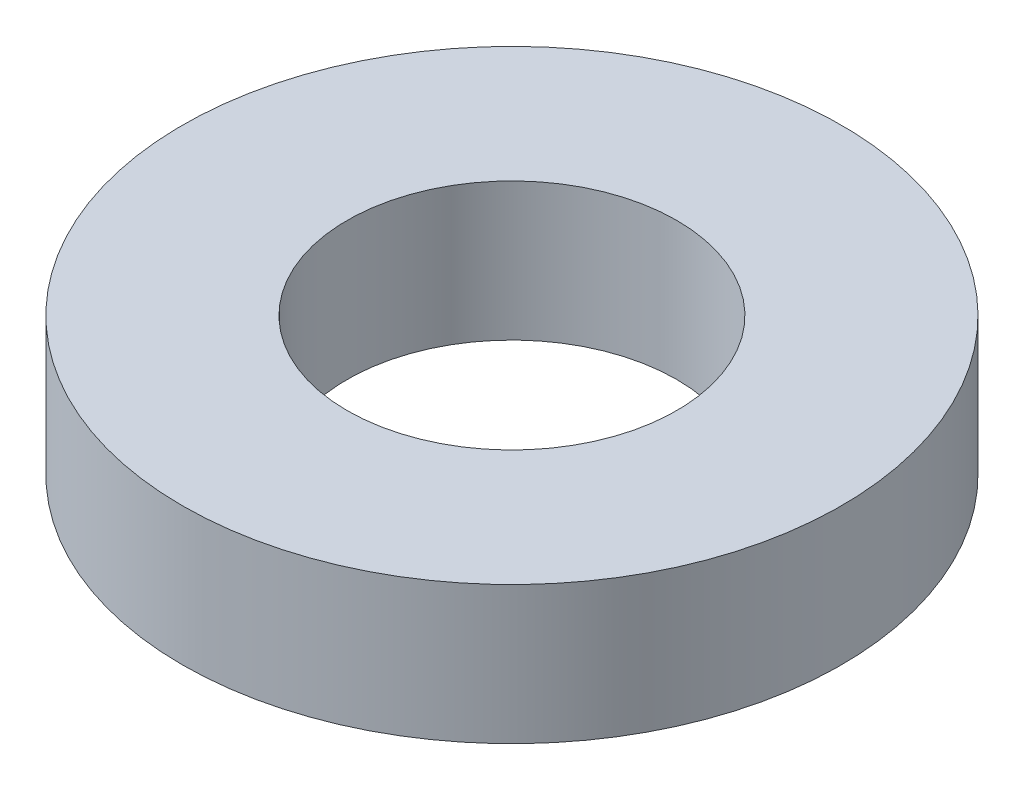
ISO-10303-21;
HEADER;
FILE_DESCRIPTION(('STEP AP214'),'2;1');
FILE_NAME('part.step','',(''),(''),'','','');
FILE_SCHEMA(('AUTOMOTIVE_DESIGN { 1 0 10303 214 1 1 1 1 }'));
ENDSEC;
DATA;
#1=APPLICATION_CONTEXT('core data for automotive mechanical design processes');
#2=APPLICATION_PROTOCOL_DEFINITION('international standard','automotive_design',2000,#1);
#3=PRODUCT_CONTEXT('',#1,'mechanical');
#4=PRODUCT('Part','Part','',(#3));
#5=PRODUCT_RELATED_PRODUCT_CATEGORY('part','',(#4));
#6=PRODUCT_DEFINITION_FORMATION('','',#4);
#7=PRODUCT_DEFINITION_CONTEXT('part definition',#1,'design');
#8=PRODUCT_DEFINITION('design','',#6,#7);
#9=PRODUCT_DEFINITION_SHAPE('','',#8);
#10=(LENGTH_UNIT() NAMED_UNIT(*) SI_UNIT(.MILLI.,.METRE.));
#11=(NAMED_UNIT(*) PLANE_ANGLE_UNIT() SI_UNIT($,.RADIAN.));
#12=(NAMED_UNIT(*) SI_UNIT($,.STERADIAN.) SOLID_ANGLE_UNIT());
#13=UNCERTAINTY_MEASURE_WITH_UNIT(LENGTH_MEASURE(1.E-05),#10,'distance_accuracy_value','');
#14=(GEOMETRIC_REPRESENTATION_CONTEXT(3) GLOBAL_UNCERTAINTY_ASSIGNED_CONTEXT((#13)) GLOBAL_UNIT_ASSIGNED_CONTEXT((#10,
#11,#12)) REPRESENTATION_CONTEXT('',''));
#15=CARTESIAN_POINT('',(0.,0.,0.));
#16=DIRECTION('',(0.,0.,1.));
#17=DIRECTION('',(1.,0.,0.));
#18=AXIS2_PLACEMENT_3D('',#15,#16,#17);
#19=CARTESIAN_POINT('',(0.,23.,0.));
#20=DIRECTION('',(0.,-1.,0.));
#21=DIRECTION('',(0.,0.,-1.));
#22=AXIS2_PLACEMENT_3D('',#19,#20,#21);
#23=CYLINDRICAL_SURFACE('',#22,55.);
#24=CARTESIAN_POINT('',(0.,23.,0.));
#25=DIRECTION('',(0.,1.,0.));
#26=DIRECTION('',(0.,0.,1.));
#27=AXIS2_PLACEMENT_3D('',#24,#25,#26);
#28=CIRCLE('',#27,55.);
#29=CARTESIAN_POINT('',(0.,23.,55.));
#30=VERTEX_POINT('',#29);
#31=EDGE_CURVE('E10',#30,#30,#28,.T.);
#32=ORIENTED_EDGE('',*,*,#31,.F.);
#33=EDGE_LOOP('',(#32));
#34=FACE_BOUND('',#33,.T.);
#35=CARTESIAN_POINT('',(0.,0.,0.));
#36=DIRECTION('',(0.,1.,0.));
#37=DIRECTION('',(0.,0.,1.));
#38=AXIS2_PLACEMENT_3D('',#35,#36,#37);
#39=CIRCLE('',#38,55.);
#40=CARTESIAN_POINT('',(0.,0.,55.));
#41=VERTEX_POINT('',#40);
#42=EDGE_CURVE('E37',#41,#41,#39,.T.);
#43=ORIENTED_EDGE('',*,*,#42,.T.);
#44=EDGE_LOOP('',(#43));
#45=FACE_BOUND('',#44,.T.);
#46=ADVANCED_FACE('F40',(#34,#45),#23,.T.);
#47=CARTESIAN_POINT('',(0.,23.,0.));
#48=DIRECTION('',(0.,1.,0.));
#49=DIRECTION('',(0.,0.,1.));
#50=AXIS2_PLACEMENT_3D('',#47,#48,#49);
#51=PLANE('',#50);
#52=CARTESIAN_POINT('',(0.,23.,0.));
#53=DIRECTION('',(0.,1.,0.));
#54=DIRECTION('',(0.,0.,1.));
#55=AXIS2_PLACEMENT_3D('',#52,#53,#54);
#56=CIRCLE('',#55,27.5);
#57=CARTESIAN_POINT('',(0.,23.,27.5));
#58=VERTEX_POINT('',#57);
#59=EDGE_CURVE('E50',#58,#58,#56,.T.);
#60=ORIENTED_EDGE('',*,*,#59,.F.);
#61=EDGE_LOOP('',(#60));
#62=FACE_BOUND('',#61,.T.);
#63=ORIENTED_EDGE('',*,*,#31,.T.);
#64=EDGE_LOOP('',(#63));
#65=FACE_BOUND('',#64,.T.);
#66=ADVANCED_FACE('F59',(#62,#65),#51,.T.);
#67=CARTESIAN_POINT('',(0.,0.,0.));
#68=DIRECTION('',(0.,1.,0.));
#69=DIRECTION('',(0.,0.,1.));
#70=AXIS2_PLACEMENT_3D('',#67,#68,#69);
#71=PLANE('',#70);
#72=CARTESIAN_POINT('',(0.,0.,0.));
#73=DIRECTION('',(0.,1.,0.));
#74=DIRECTION('',(0.,0.,1.));
#75=AXIS2_PLACEMENT_3D('',#72,#73,#74);
#76=CIRCLE('',#75,27.5);
#77=CARTESIAN_POINT('',(0.,0.,27.5));
#78=VERTEX_POINT('',#77);
#79=EDGE_CURVE('E47',#78,#78,#76,.T.);
#80=ORIENTED_EDGE('',*,*,#79,.T.);
#81=EDGE_LOOP('',(#80));
#82=FACE_BOUND('',#81,.T.);
#83=ORIENTED_EDGE('',*,*,#42,.F.);
#84=EDGE_LOOP('',(#83));
#85=FACE_BOUND('',#84,.T.);
#86=ADVANCED_FACE('F58',(#82,#85),#71,.F.);
#87=CARTESIAN_POINT('',(0.,23.,0.));
#88=DIRECTION('',(0.,-1.,0.));
#89=DIRECTION('',(0.,0.,-1.));
#90=AXIS2_PLACEMENT_3D('',#87,#88,#89);
#91=CYLINDRICAL_SURFACE('',#90,27.5);
#92=ORIENTED_EDGE('',*,*,#59,.T.);
#93=EDGE_LOOP('',(#92));
#94=FACE_BOUND('',#93,.T.);
#95=ORIENTED_EDGE('',*,*,#79,.F.);
#96=EDGE_LOOP('',(#95));
#97=FACE_BOUND('',#96,.T.);
#98=ADVANCED_FACE('F54',(#94,#97),#91,.F.);
#99=CLOSED_SHELL('',(#46,#66,#86,#98));
#100=MANIFOLD_SOLID_BREP('B2',#99);
#101=ADVANCED_BREP_SHAPE_REPRESENTATION('',(#18,#100),#14);
#102=SHAPE_DEFINITION_REPRESENTATION(#9,#101);
ENDSEC;
END-ISO-10303-21;
